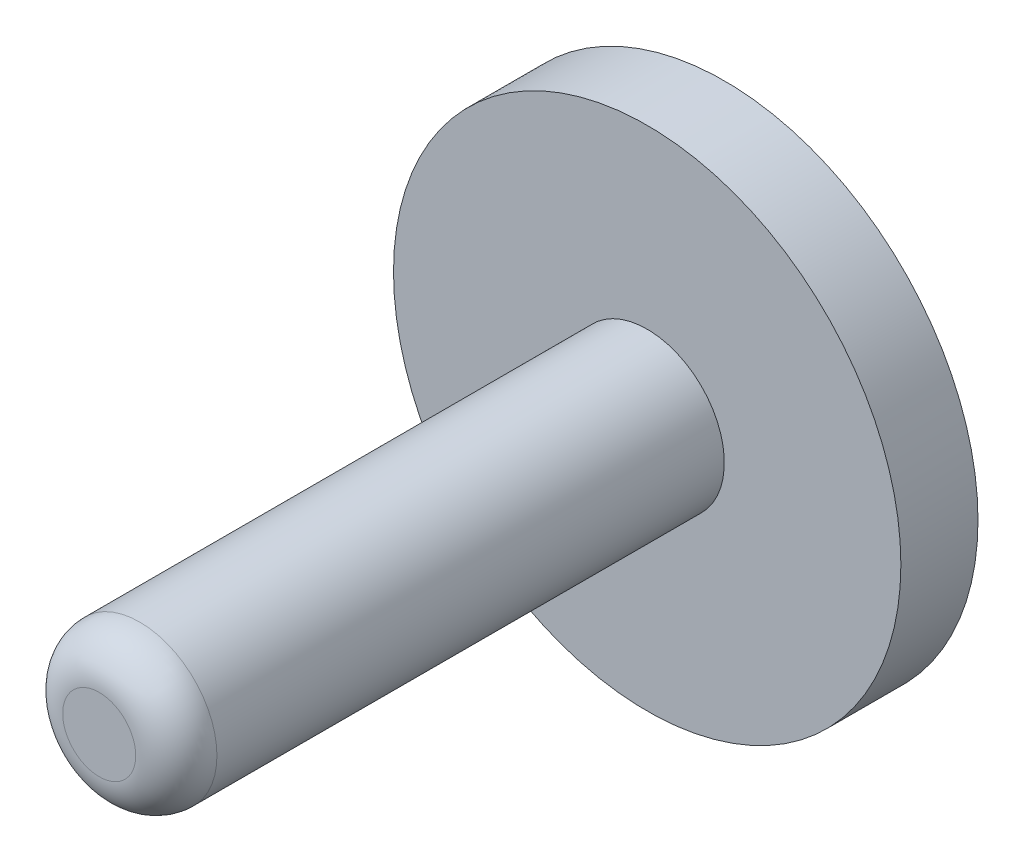
ISO-10303-21;
HEADER;
FILE_DESCRIPTION(('STEP AP214'),'2;1');
FILE_NAME('part.step','',(''),(''),'','','');
FILE_SCHEMA(('AUTOMOTIVE_DESIGN { 1 0 10303 214 1 1 1 1 }'));
ENDSEC;
DATA;
#1=APPLICATION_CONTEXT('core data for automotive mechanical design processes');
#2=APPLICATION_PROTOCOL_DEFINITION('international standard','automotive_design',2000,#1);
#3=PRODUCT_CONTEXT('',#1,'mechanical');
#4=PRODUCT('Part','Part','',(#3));
#5=PRODUCT_RELATED_PRODUCT_CATEGORY('part','',(#4));
#6=PRODUCT_DEFINITION_FORMATION('','',#4);
#7=PRODUCT_DEFINITION_CONTEXT('part definition',#1,'design');
#8=PRODUCT_DEFINITION('design','',#6,#7);
#9=PRODUCT_DEFINITION_SHAPE('','',#8);
#10=(LENGTH_UNIT() NAMED_UNIT(*) SI_UNIT(.MILLI.,.METRE.));
#11=(NAMED_UNIT(*) PLANE_ANGLE_UNIT() SI_UNIT($,.RADIAN.));
#12=(NAMED_UNIT(*) SI_UNIT($,.STERADIAN.) SOLID_ANGLE_UNIT());
#13=UNCERTAINTY_MEASURE_WITH_UNIT(LENGTH_MEASURE(1.E-05),#10,'distance_accuracy_value','');
#14=(GEOMETRIC_REPRESENTATION_CONTEXT(3) GLOBAL_UNCERTAINTY_ASSIGNED_CONTEXT((#13)) GLOBAL_UNIT_ASSIGNED_CONTEXT((#10,
#11,#12)) REPRESENTATION_CONTEXT('',''));
#15=CARTESIAN_POINT('',(0.,0.,0.));
#16=DIRECTION('',(0.,0.,1.));
#17=DIRECTION('',(1.,0.,0.));
#18=AXIS2_PLACEMENT_3D('',#15,#16,#17);
#19=CARTESIAN_POINT('',(0.,0.,-3.8));
#20=DIRECTION('',(0.,0.,-1.));
#21=DIRECTION('',(-1.,0.,0.));
#22=AXIS2_PLACEMENT_3D('',#19,#20,#21);
#23=PLANE('',#22);
#24=CARTESIAN_POINT('',(0.,0.,-3.8));
#25=DIRECTION('',(0.,0.,-1.));
#26=DIRECTION('',(-1.,0.,0.));
#27=AXIS2_PLACEMENT_3D('',#24,#25,#26);
#28=CIRCLE('',#27,12.5);
#29=CARTESIAN_POINT('',(-12.5,0.,-3.8));
#30=VERTEX_POINT('',#29);
#31=EDGE_CURVE('E48',#30,#30,#28,.T.);
#32=ORIENTED_EDGE('',*,*,#31,.T.);
#33=EDGE_LOOP('',(#32));
#34=FACE_BOUND('',#33,.T.);
#35=CARTESIAN_POINT('',(0.,0.,-3.80000000001246));
#36=DIRECTION('',(0.,0.,-1.));
#37=DIRECTION('',(-1.,0.,0.));
#38=AXIS2_PLACEMENT_3D('',#35,#36,#37);
#39=CIRCLE('',#38,1.6);
#40=CARTESIAN_POINT('',(1.6,0.,-3.80000000001246));
#41=VERTEX_POINT('',#40);
#42=EDGE_CURVE('E59',#41,#41,#39,.T.);
#43=ORIENTED_EDGE('',*,*,#42,.F.);
#44=EDGE_LOOP('',(#43));
#45=FACE_BOUND('',#44,.T.);
#46=ADVANCED_FACE('F33',(#34,#45),#23,.T.);
#47=CARTESIAN_POINT('',(0.,0.,27.));
#48=DIRECTION('',(0.,0.,-1.));
#49=DIRECTION('',(-1.,0.,0.));
#50=AXIS2_PLACEMENT_3D('',#47,#48,#49);
#51=CYLINDRICAL_SURFACE('',#50,3.8);
#52=CARTESIAN_POINT('',(0.,0.,25.));
#53=DIRECTION('',(0.,0.,1.));
#54=DIRECTION('',(1.,0.,0.));
#55=AXIS2_PLACEMENT_3D('',#52,#53,#54);
#56=CIRCLE('',#55,3.8);
#57=CARTESIAN_POINT('',(3.8,0.,25.));
#58=VERTEX_POINT('',#57);
#59=EDGE_CURVE('E11',#58,#58,#56,.F.);
#60=ORIENTED_EDGE('',*,*,#59,.T.);
#61=EDGE_LOOP('',(#60));
#62=FACE_BOUND('',#61,.T.);
#63=CARTESIAN_POINT('',(0.,0.,0.));
#64=DIRECTION('',(0.,0.,-1.));
#65=DIRECTION('',(-1.,0.,0.));
#66=AXIS2_PLACEMENT_3D('',#63,#64,#65);
#67=CIRCLE('',#66,3.8);
#68=CARTESIAN_POINT('',(-3.8,0.,0.));
#69=VERTEX_POINT('',#68);
#70=EDGE_CURVE('E44',#69,#69,#67,.T.);
#71=ORIENTED_EDGE('',*,*,#70,.F.);
#72=EDGE_LOOP('',(#71));
#73=FACE_BOUND('',#72,.T.);
#74=ADVANCED_FACE('F67',(#62,#73),#51,.T.);
#75=CARTESIAN_POINT('',(0.,0.,27.));
#76=DIRECTION('',(0.,0.,1.));
#77=DIRECTION('',(1.,0.,0.));
#78=AXIS2_PLACEMENT_3D('',#75,#76,#77);
#79=PLANE('',#78);
#80=CARTESIAN_POINT('',(0.,0.,27.));
#81=DIRECTION('',(0.,0.,1.));
#82=DIRECTION('',(1.,0.,0.));
#83=AXIS2_PLACEMENT_3D('',#80,#81,#82);
#84=CIRCLE('',#83,1.8);
#85=CARTESIAN_POINT('',(1.8,0.,27.));
#86=VERTEX_POINT('',#85);
#87=EDGE_CURVE('E40',#86,#86,#84,.T.);
#88=ORIENTED_EDGE('',*,*,#87,.T.);
#89=EDGE_LOOP('',(#88));
#90=FACE_BOUND('',#89,.T.);
#91=ADVANCED_FACE('F73',(#90),#79,.T.);
#92=CARTESIAN_POINT('',(0.,0.,0.));
#93=DIRECTION('',(0.,0.,-1.));
#94=DIRECTION('',(-1.,0.,0.));
#95=AXIS2_PLACEMENT_3D('',#92,#93,#94);
#96=PLANE('',#95);
#97=CARTESIAN_POINT('',(0.,0.,0.));
#98=DIRECTION('',(0.,0.,-1.));
#99=DIRECTION('',(-1.,0.,0.));
#100=AXIS2_PLACEMENT_3D('',#97,#98,#99);
#101=CIRCLE('',#100,12.5);
#102=CARTESIAN_POINT('',(-12.5,0.,0.));
#103=VERTEX_POINT('',#102);
#104=EDGE_CURVE('E53',#103,#103,#101,.T.);
#105=ORIENTED_EDGE('',*,*,#104,.F.);
#106=EDGE_LOOP('',(#105));
#107=FACE_BOUND('',#106,.T.);
#108=ORIENTED_EDGE('',*,*,#70,.T.);
#109=EDGE_LOOP('',(#108));
#110=FACE_BOUND('',#109,.T.);
#111=ADVANCED_FACE('F78',(#107,#110),#96,.F.);
#112=CARTESIAN_POINT('',(0.,0.,0.));
#113=DIRECTION('',(0.,0.,-1.));
#114=DIRECTION('',(-1.,0.,0.));
#115=AXIS2_PLACEMENT_3D('',#112,#113,#114);
#116=CYLINDRICAL_SURFACE('',#115,12.5);
#117=CARTESIAN_POINT('',(-12.5,0.,0.));
#118=CARTESIAN_POINT('',(-12.5,0.,-0.0395833333333333));
#119=CARTESIAN_POINT('',(-12.5,0.,-0.0791666666666667));
#120=CARTESIAN_POINT('',(-12.5,0.,-0.158333333333333));
#121=CARTESIAN_POINT('',(-12.5,0.,-0.197916666666667));
#122=CARTESIAN_POINT('',(-12.5,0.,-0.277083333333333));
#123=CARTESIAN_POINT('',(-12.5,0.,-0.316666666666667));
#124=CARTESIAN_POINT('',(-12.5,0.,-0.395833333333333));
#125=CARTESIAN_POINT('',(-12.5,0.,-0.435416666666667));
#126=CARTESIAN_POINT('',(-12.5,0.,-0.514583333333333));
#127=CARTESIAN_POINT('',(-12.5,0.,-0.554166666666667));
#128=CARTESIAN_POINT('',(-12.5,0.,-0.633333333333333));
#129=CARTESIAN_POINT('',(-12.5,0.,-0.672916666666667));
#130=CARTESIAN_POINT('',(-12.5,0.,-0.752083333333333));
#131=CARTESIAN_POINT('',(-12.5,0.,-0.791666666666667));
#132=CARTESIAN_POINT('',(-12.5,0.,-0.870833333333333));
#133=CARTESIAN_POINT('',(-12.5,0.,-0.910416666666667));
#134=CARTESIAN_POINT('',(-12.5,0.,-0.989583333333333));
#135=CARTESIAN_POINT('',(-12.5,0.,-1.02916666666667));
#136=CARTESIAN_POINT('',(-12.5,0.,-1.10833333333333));
#137=CARTESIAN_POINT('',(-12.5,0.,-1.14791666666667));
#138=CARTESIAN_POINT('',(-12.5,0.,-1.22708333333333));
#139=CARTESIAN_POINT('',(-12.5,0.,-1.26666666666667));
#140=CARTESIAN_POINT('',(-12.5,0.,-1.34583333333333));
#141=CARTESIAN_POINT('',(-12.5,0.,-1.38541666666667));
#142=CARTESIAN_POINT('',(-12.5,0.,-1.46458333333333));
#143=CARTESIAN_POINT('',(-12.5,0.,-1.50416666666667));
#144=CARTESIAN_POINT('',(-12.5,0.,-1.58333333333333));
#145=CARTESIAN_POINT('',(-12.5,0.,-1.62291666666667));
#146=CARTESIAN_POINT('',(-12.5,0.,-1.70208333333333));
#147=CARTESIAN_POINT('',(-12.5,0.,-1.74166666666667));
#148=CARTESIAN_POINT('',(-12.5,0.,-1.82083333333333));
#149=CARTESIAN_POINT('',(-12.5,0.,-1.86041666666667));
#150=CARTESIAN_POINT('',(-12.5,0.,-1.93958333333333));
#151=CARTESIAN_POINT('',(-12.5,0.,-1.97916666666667));
#152=CARTESIAN_POINT('',(-12.5,0.,-2.05833333333333));
#153=CARTESIAN_POINT('',(-12.5,0.,-2.09791666666667));
#154=CARTESIAN_POINT('',(-12.5,0.,-2.17708333333333));
#155=CARTESIAN_POINT('',(-12.5,0.,-2.21666666666667));
#156=CARTESIAN_POINT('',(-12.5,0.,-2.29583333333333));
#157=CARTESIAN_POINT('',(-12.5,0.,-2.33541666666667));
#158=CARTESIAN_POINT('',(-12.5,0.,-2.41458333333333));
#159=CARTESIAN_POINT('',(-12.5,0.,-2.45416666666667));
#160=CARTESIAN_POINT('',(-12.5,0.,-2.53333333333333));
#161=CARTESIAN_POINT('',(-12.5,0.,-2.57291666666667));
#162=CARTESIAN_POINT('',(-12.5,0.,-2.65208333333333));
#163=CARTESIAN_POINT('',(-12.5,0.,-2.69166666666667));
#164=CARTESIAN_POINT('',(-12.5,0.,-2.77083333333333));
#165=CARTESIAN_POINT('',(-12.5,0.,-2.81041666666667));
#166=CARTESIAN_POINT('',(-12.5,0.,-2.88958333333333));
#167=CARTESIAN_POINT('',(-12.5,0.,-2.92916666666667));
#168=CARTESIAN_POINT('',(-12.5,0.,-3.00833333333333));
#169=CARTESIAN_POINT('',(-12.5,0.,-3.04791666666667));
#170=CARTESIAN_POINT('',(-12.5,0.,-3.12708333333333));
#171=CARTESIAN_POINT('',(-12.5,0.,-3.16666666666667));
#172=CARTESIAN_POINT('',(-12.5,0.,-3.24583333333333));
#173=CARTESIAN_POINT('',(-12.5,0.,-3.28541666666667));
#174=CARTESIAN_POINT('',(-12.5,0.,-3.36458333333333));
#175=CARTESIAN_POINT('',(-12.5,0.,-3.40416666666667));
#176=CARTESIAN_POINT('',(-12.5,0.,-3.48333333333333));
#177=CARTESIAN_POINT('',(-12.5,0.,-3.52291666666667));
#178=CARTESIAN_POINT('',(-12.5,0.,-3.60208333333333));
#179=CARTESIAN_POINT('',(-12.5,0.,-3.64166666666667));
#180=CARTESIAN_POINT('',(-12.5,0.,-3.72083333333333));
#181=CARTESIAN_POINT('',(-12.5,0.,-3.76041666666667));
#182=CARTESIAN_POINT('',(-12.5,0.,-3.8));
#183=B_SPLINE_CURVE_WITH_KNOTS('',3,(#117,#118,#119,#120,#121,#122,#123,#124,#125,#126,#127,
#128,#129,#130,#131,#132,#133,#134,#135,#136,#137,#138,#139,#140,#141,#142,#143,#144,#145,#146,
#147,#148,#149,#150,#151,#152,#153,#154,#155,#156,#157,#158,#159,#160,#161,#162,#163,#164,#165,
#166,#167,#168,#169,#170,#171,#172,#173,#174,#175,#176,#177,#178,#179,#180,#181,#182),
.UNSPECIFIED.,.F.,.F.,(4,2,2,2,2,2,2,2,2,2,2,2,2,2,2,2,2,2,2,2,2,2,2,2,2,2,2,2,2,2,2,2,4),(0.,
0.11875,0.2375,0.35625,0.475,0.59375,0.7125,0.83125,0.95,1.06875,1.1875,1.30625,1.425,1.54375,
1.6625,1.78125,1.9,2.01875,2.1375,2.25625,2.375,2.49375,2.6125,2.73125,2.85,2.96875,3.0875,
3.20625,3.325,3.44375,3.5625,3.68125,3.8),.UNSPECIFIED.);
#184=EDGE_CURVE('BSEAM76',#103,#30,#183,.T.);
#185=ORIENTED_EDGE('',*,*,#104,.T.);
#186=ORIENTED_EDGE('',*,*,#31,.F.);
#187=ORIENTED_EDGE('',*,*,#184,.T.);
#188=ORIENTED_EDGE('',*,*,#184,.F.);
#189=EDGE_LOOP('',(#185,#187,#186,#188));
#190=FACE_BOUND('',#189,.T.);
#191=ADVANCED_FACE('F76',(#190),#116,.T.);
#192=CARTESIAN_POINT('',(0.,0.,6.19999999998754));
#193=DIRECTION('',(0.,0.,1.));
#194=DIRECTION('',(1.,0.,0.));
#195=AXIS2_PLACEMENT_3D('',#192,#193,#194);
#196=PLANE('',#195);
#197=CARTESIAN_POINT('',(0.,0.,6.19999999998754));
#198=DIRECTION('',(0.,0.,-1.));
#199=DIRECTION('',(-1.,0.,0.));
#200=AXIS2_PLACEMENT_3D('',#197,#198,#199);
#201=CIRCLE('',#200,1.6);
#202=CARTESIAN_POINT('',(1.6,0.,6.19999999998754));
#203=VERTEX_POINT('',#202);
#204=EDGE_CURVE('E56',#203,#203,#201,.T.);
#205=ORIENTED_EDGE('',*,*,#204,.T.);
#206=EDGE_LOOP('',(#205));
#207=FACE_BOUND('',#206,.T.);
#208=ADVANCED_FACE('F98',(#207),#196,.F.);
#209=CARTESIAN_POINT('',(0.,0.,-3.80000000001246));
#210=DIRECTION('',(0.,0.,1.));
#211=DIRECTION('',(1.,0.,0.));
#212=AXIS2_PLACEMENT_3D('',#209,#210,#211);
#213=CYLINDRICAL_SURFACE('',#212,1.6);
#214=CARTESIAN_POINT('',(1.6,0.,-3.80000000001246));
#215=CARTESIAN_POINT('',(1.6,0.,-3.69583333334579));
#216=CARTESIAN_POINT('',(1.6,0.,-3.59166666667913));
#217=CARTESIAN_POINT('',(1.6,0.,-3.38333333334579));
#218=CARTESIAN_POINT('',(1.6,0.,-3.27916666667913));
#219=CARTESIAN_POINT('',(1.6,0.,-3.07083333334579));
#220=CARTESIAN_POINT('',(1.6,0.,-2.96666666667913));
#221=CARTESIAN_POINT('',(1.6,0.,-2.75833333334579));
#222=CARTESIAN_POINT('',(1.6,0.,-2.65416666667913));
#223=CARTESIAN_POINT('',(1.6,0.,-2.44583333334579));
#224=CARTESIAN_POINT('',(1.6,0.,-2.34166666667913));
#225=CARTESIAN_POINT('',(1.6,0.,-2.13333333334579));
#226=CARTESIAN_POINT('',(1.6,0.,-2.02916666667913));
#227=CARTESIAN_POINT('',(1.6,0.,-1.82083333334579));
#228=CARTESIAN_POINT('',(1.6,0.,-1.71666666667913));
#229=CARTESIAN_POINT('',(1.6,0.,-1.50833333334579));
#230=CARTESIAN_POINT('',(1.6,0.,-1.40416666667913));
#231=CARTESIAN_POINT('',(1.6,0.,-1.19583333334579));
#232=CARTESIAN_POINT('',(1.6,0.,-1.09166666667913));
#233=CARTESIAN_POINT('',(1.6,0.,-0.883333333345793));
#234=CARTESIAN_POINT('',(1.6,0.,-0.779166666679126));
#235=CARTESIAN_POINT('',(1.6,0.,-0.570833333345793));
#236=CARTESIAN_POINT('',(1.6,0.,-0.466666666679126));
#237=CARTESIAN_POINT('',(1.6,0.,-0.258333333345793));
#238=CARTESIAN_POINT('',(1.6,0.,-0.154166666679126));
#239=CARTESIAN_POINT('',(1.6,0.,0.0541666666542074));
#240=CARTESIAN_POINT('',(1.6,0.,0.158333333320874));
#241=CARTESIAN_POINT('',(1.6,0.,0.366666666654207));
#242=CARTESIAN_POINT('',(1.6,0.,0.470833333320874));
#243=CARTESIAN_POINT('',(1.6,0.,0.679166666654207));
#244=CARTESIAN_POINT('',(1.6,0.,0.783333333320874));
#245=CARTESIAN_POINT('',(1.6,0.,0.991666666654207));
#246=CARTESIAN_POINT('',(1.6,0.,1.09583333332087));
#247=CARTESIAN_POINT('',(1.6,0.,1.30416666665421));
#248=CARTESIAN_POINT('',(1.6,0.,1.40833333332087));
#249=CARTESIAN_POINT('',(1.6,0.,1.61666666665421));
#250=CARTESIAN_POINT('',(1.6,0.,1.72083333332087));
#251=CARTESIAN_POINT('',(1.6,0.,1.92916666665421));
#252=CARTESIAN_POINT('',(1.6,0.,2.03333333332087));
#253=CARTESIAN_POINT('',(1.6,0.,2.24166666665421));
#254=CARTESIAN_POINT('',(1.6,0.,2.34583333332087));
#255=CARTESIAN_POINT('',(1.6,0.,2.55416666665421));
#256=CARTESIAN_POINT('',(1.6,0.,2.65833333332087));
#257=CARTESIAN_POINT('',(1.6,0.,2.86666666665421));
#258=CARTESIAN_POINT('',(1.6,0.,2.97083333332087));
#259=CARTESIAN_POINT('',(1.6,0.,3.17916666665421));
#260=CARTESIAN_POINT('',(1.6,0.,3.28333333332087));
#261=CARTESIAN_POINT('',(1.6,0.,3.49166666665421));
#262=CARTESIAN_POINT('',(1.6,0.,3.59583333332087));
#263=CARTESIAN_POINT('',(1.6,0.,3.80416666665421));
#264=CARTESIAN_POINT('',(1.6,0.,3.90833333332088));
#265=CARTESIAN_POINT('',(1.6,0.,4.11666666665421));
#266=CARTESIAN_POINT('',(1.6,0.,4.22083333332088));
#267=CARTESIAN_POINT('',(1.6,0.,4.42916666665421));
#268=CARTESIAN_POINT('',(1.6,0.,4.53333333332088));
#269=CARTESIAN_POINT('',(1.6,0.,4.74166666665421));
#270=CARTESIAN_POINT('',(1.6,0.,4.84583333332087));
#271=CARTESIAN_POINT('',(1.6,0.,5.05416666665421));
#272=CARTESIAN_POINT('',(1.6,0.,5.15833333332087));
#273=CARTESIAN_POINT('',(1.6,0.,5.36666666665421));
#274=CARTESIAN_POINT('',(1.6,0.,5.47083333332087));
#275=CARTESIAN_POINT('',(1.6,0.,5.67916666665421));
#276=CARTESIAN_POINT('',(1.6,0.,5.78333333332087));
#277=CARTESIAN_POINT('',(1.6,0.,5.99166666665421));
#278=CARTESIAN_POINT('',(1.6,0.,6.09583333332088));
#279=CARTESIAN_POINT('',(1.6,0.,6.19999999998754));
#280=B_SPLINE_CURVE_WITH_KNOTS('',3,(#214,#215,#216,#217,#218,#219,#220,#221,#222,#223,#224,
#225,#226,#227,#228,#229,#230,#231,#232,#233,#234,#235,#236,#237,#238,#239,#240,#241,#242,#243,
#244,#245,#246,#247,#248,#249,#250,#251,#252,#253,#254,#255,#256,#257,#258,#259,#260,#261,#262,
#263,#264,#265,#266,#267,#268,#269,#270,#271,#272,#273,#274,#275,#276,#277,#278,#279),
.UNSPECIFIED.,.F.,.F.,(4,2,2,2,2,2,2,2,2,2,2,2,2,2,2,2,2,2,2,2,2,2,2,2,2,2,2,2,2,2,2,2,4),(0.,
0.3125,0.625000000000001,0.9375,1.25,1.5625,1.875,2.1875,2.5,2.8125,3.125,3.4375,3.75,4.0625,
4.375,4.6875,5.,5.3125,5.625,5.9375,6.25,6.5625,6.875,7.1875,7.5,7.8125,8.125,8.4375,8.75,
9.0625,9.375,9.6875,10.),.UNSPECIFIED.);
#281=EDGE_CURVE('BSEAM63',#41,#203,#280,.T.);
#282=ORIENTED_EDGE('',*,*,#42,.T.);
#283=ORIENTED_EDGE('',*,*,#204,.F.);
#284=ORIENTED_EDGE('',*,*,#281,.T.);
#285=ORIENTED_EDGE('',*,*,#281,.F.);
#286=EDGE_LOOP('',(#282,#284,#283,#285));
#287=FACE_BOUND('',#286,.T.);
#288=ADVANCED_FACE('F63',(#287),#213,.F.);
#289=CARTESIAN_POINT('',(0.,0.,25.));
#290=DIRECTION('',(0.,0.,1.));
#291=DIRECTION('',(1.,0.,0.));
#292=AXIS2_PLACEMENT_3D('',#289,#290,#291);
#293=DEGENERATE_TOROIDAL_SURFACE('',#292,1.8,2.,.T.);
#294=ORIENTED_EDGE('',*,*,#59,.F.);
#295=EDGE_LOOP('',(#294));
#296=FACE_BOUND('',#295,.T.);
#297=ORIENTED_EDGE('',*,*,#87,.F.);
#298=EDGE_LOOP('',(#297));
#299=FACE_BOUND('',#298,.T.);
#300=ADVANCED_FACE('F35',(#296,#299),#293,.T.);
#301=CLOSED_SHELL('',(#46,#74,#91,#111,#191,#208,#288,#300));
#302=MANIFOLD_SOLID_BREP('B2',#301);
#303=ADVANCED_BREP_SHAPE_REPRESENTATION('',(#18,#302),#14);
#304=SHAPE_DEFINITION_REPRESENTATION(#9,#303);
ENDSEC;
END-ISO-10303-21;
